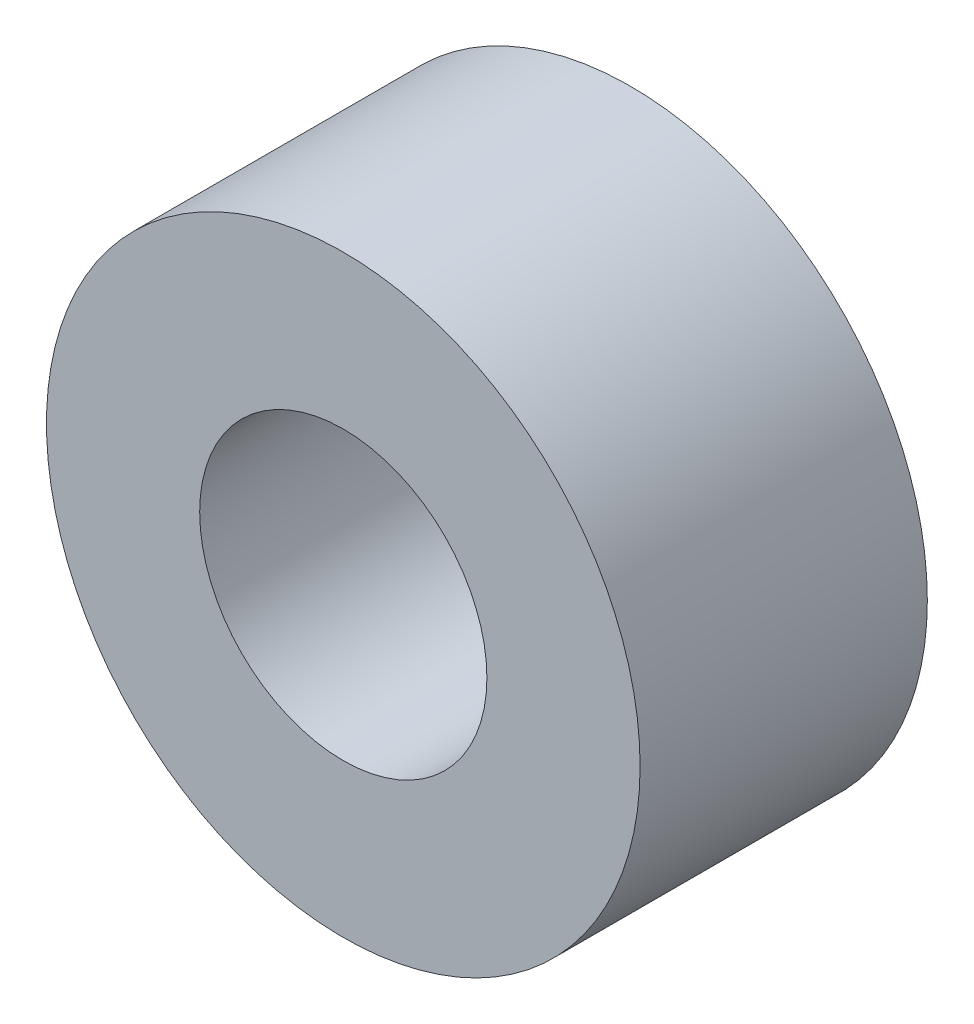
ISO-10303-21;
HEADER;
FILE_DESCRIPTION(('STEP AP214'),'2;1');
FILE_NAME('part.step','',(''),(''),'','','');
FILE_SCHEMA(('AUTOMOTIVE_DESIGN { 1 0 10303 214 1 1 1 1 }'));
ENDSEC;
DATA;
#1=APPLICATION_CONTEXT('core data for automotive mechanical design processes');
#2=APPLICATION_PROTOCOL_DEFINITION('international standard','automotive_design',2000,#1);
#3=PRODUCT_CONTEXT('',#1,'mechanical');
#4=PRODUCT('Part','Part','',(#3));
#5=PRODUCT_RELATED_PRODUCT_CATEGORY('part','',(#4));
#6=PRODUCT_DEFINITION_FORMATION('','',#4);
#7=PRODUCT_DEFINITION_CONTEXT('part definition',#1,'design');
#8=PRODUCT_DEFINITION('design','',#6,#7);
#9=PRODUCT_DEFINITION_SHAPE('','',#8);
#10=(LENGTH_UNIT() NAMED_UNIT(*) SI_UNIT(.MILLI.,.METRE.));
#11=(NAMED_UNIT(*) PLANE_ANGLE_UNIT() SI_UNIT($,.RADIAN.));
#12=(NAMED_UNIT(*) SI_UNIT($,.STERADIAN.) SOLID_ANGLE_UNIT());
#13=UNCERTAINTY_MEASURE_WITH_UNIT(LENGTH_MEASURE(1.E-05),#10,'distance_accuracy_value','');
#14=(GEOMETRIC_REPRESENTATION_CONTEXT(3) GLOBAL_UNCERTAINTY_ASSIGNED_CONTEXT((#13)) GLOBAL_UNIT_ASSIGNED_CONTEXT((#10,
#11,#12)) REPRESENTATION_CONTEXT('',''));
#15=CARTESIAN_POINT('',(0.,0.,0.));
#16=DIRECTION('',(0.,0.,1.));
#17=DIRECTION('',(1.,0.,0.));
#18=AXIS2_PLACEMENT_3D('',#15,#16,#17);
#19=CARTESIAN_POINT('',(0.,0.,3.));
#20=DIRECTION('',(0.,0.,1.));
#21=DIRECTION('',(1.,0.,0.));
#22=AXIS2_PLACEMENT_3D('',#19,#20,#21);
#23=PLANE('',#22);
#24=CARTESIAN_POINT('',(0.,0.,3.));
#25=DIRECTION('',(0.,0.,1.));
#26=DIRECTION('',(1.,0.,0.));
#27=AXIS2_PLACEMENT_3D('',#24,#25,#26);
#28=CIRCLE('',#27,3.1);
#29=CARTESIAN_POINT('',(3.1,0.,3.));
#30=VERTEX_POINT('',#29);
#31=EDGE_CURVE('E10',#30,#30,#28,.T.);
#32=ORIENTED_EDGE('',*,*,#31,.T.);
#33=EDGE_LOOP('',(#32));
#34=FACE_BOUND('',#33,.T.);
#35=CARTESIAN_POINT('',(0.,0.,3.));
#36=DIRECTION('',(0.,0.,1.));
#37=DIRECTION('',(1.,0.,0.));
#38=AXIS2_PLACEMENT_3D('',#35,#36,#37);
#39=CIRCLE('',#38,1.5);
#40=CARTESIAN_POINT('',(1.5,0.,3.));
#41=VERTEX_POINT('',#40);
#42=EDGE_CURVE('E50',#41,#41,#39,.T.);
#43=ORIENTED_EDGE('',*,*,#42,.F.);
#44=EDGE_LOOP('',(#43));
#45=FACE_BOUND('',#44,.T.);
#46=ADVANCED_FACE('F37',(#34,#45),#23,.T.);
#47=CARTESIAN_POINT('',(0.,0.,0.));
#48=DIRECTION('',(0.,0.,1.));
#49=DIRECTION('',(1.,0.,0.));
#50=AXIS2_PLACEMENT_3D('',#47,#48,#49);
#51=PLANE('',#50);
#52=CARTESIAN_POINT('',(0.,0.,0.));
#53=DIRECTION('',(0.,0.,1.));
#54=DIRECTION('',(1.,0.,0.));
#55=AXIS2_PLACEMENT_3D('',#52,#53,#54);
#56=CIRCLE('',#55,3.1);
#57=CARTESIAN_POINT('',(3.1,0.,0.));
#58=VERTEX_POINT('',#57);
#59=EDGE_CURVE('E41',#58,#58,#56,.T.);
#60=ORIENTED_EDGE('',*,*,#59,.F.);
#61=EDGE_LOOP('',(#60));
#62=FACE_BOUND('',#61,.T.);
#63=CARTESIAN_POINT('',(0.,0.,0.));
#64=DIRECTION('',(0.,0.,1.));
#65=DIRECTION('',(1.,0.,0.));
#66=AXIS2_PLACEMENT_3D('',#63,#64,#65);
#67=CIRCLE('',#66,1.5);
#68=CARTESIAN_POINT('',(1.5,0.,0.));
#69=VERTEX_POINT('',#68);
#70=EDGE_CURVE('E52',#69,#69,#67,.T.);
#71=ORIENTED_EDGE('',*,*,#70,.T.);
#72=EDGE_LOOP('',(#71));
#73=FACE_BOUND('',#72,.T.);
#74=ADVANCED_FACE('F64',(#62,#73),#51,.F.);
#75=CARTESIAN_POINT('',(0.,0.,3.));
#76=DIRECTION('',(0.,0.,-1.));
#77=DIRECTION('',(-1.,0.,0.));
#78=AXIS2_PLACEMENT_3D('',#75,#76,#77);
#79=CYLINDRICAL_SURFACE('',#78,3.1);
#80=ORIENTED_EDGE('',*,*,#31,.F.);
#81=EDGE_LOOP('',(#80));
#82=FACE_BOUND('',#81,.T.);
#83=ORIENTED_EDGE('',*,*,#59,.T.);
#84=EDGE_LOOP('',(#83));
#85=FACE_BOUND('',#84,.T.);
#86=ADVANCED_FACE('F39',(#82,#85),#79,.T.);
#87=CARTESIAN_POINT('',(0.,0.,3.));
#88=DIRECTION('',(0.,0.,-1.));
#89=DIRECTION('',(-1.,0.,0.));
#90=AXIS2_PLACEMENT_3D('',#87,#88,#89);
#91=CYLINDRICAL_SURFACE('',#90,1.5);
#92=ORIENTED_EDGE('',*,*,#42,.T.);
#93=EDGE_LOOP('',(#92));
#94=FACE_BOUND('',#93,.T.);
#95=ORIENTED_EDGE('',*,*,#70,.F.);
#96=EDGE_LOOP('',(#95));
#97=FACE_BOUND('',#96,.T.);
#98=ADVANCED_FACE('F60',(#94,#97),#91,.F.);
#99=CLOSED_SHELL('',(#46,#74,#86,#98));
#100=MANIFOLD_SOLID_BREP('B2',#99);
#101=ADVANCED_BREP_SHAPE_REPRESENTATION('',(#18,#100),#14);
#102=SHAPE_DEFINITION_REPRESENTATION(#9,#101);
ENDSEC;
END-ISO-10303-21;
